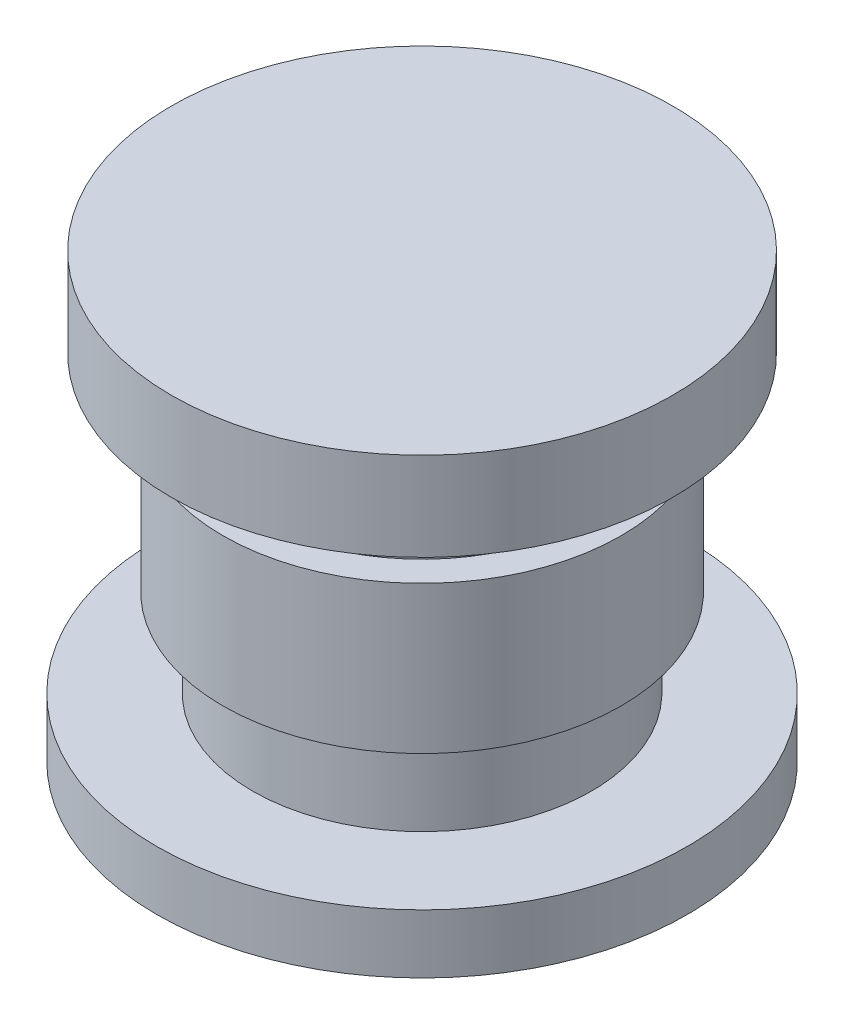
ISO-10303-21;
HEADER;
FILE_DESCRIPTION(('STEP AP214'),'2;1');
FILE_NAME('part.step','',(''),(''),'','','');
FILE_SCHEMA(('AUTOMOTIVE_DESIGN { 1 0 10303 214 1 1 1 1 }'));
ENDSEC;
DATA;
#1=APPLICATION_CONTEXT('core data for automotive mechanical design processes');
#2=APPLICATION_PROTOCOL_DEFINITION('international standard','automotive_design',2000,#1);
#3=PRODUCT_CONTEXT('',#1,'mechanical');
#4=PRODUCT('Part','Part','',(#3));
#5=PRODUCT_RELATED_PRODUCT_CATEGORY('part','',(#4));
#6=PRODUCT_DEFINITION_FORMATION('','',#4);
#7=PRODUCT_DEFINITION_CONTEXT('part definition',#1,'design');
#8=PRODUCT_DEFINITION('design','',#6,#7);
#9=PRODUCT_DEFINITION_SHAPE('','',#8);
#10=(LENGTH_UNIT() NAMED_UNIT(*) SI_UNIT(.MILLI.,.METRE.));
#11=(NAMED_UNIT(*) PLANE_ANGLE_UNIT() SI_UNIT($,.RADIAN.));
#12=(NAMED_UNIT(*) SI_UNIT($,.STERADIAN.) SOLID_ANGLE_UNIT());
#13=UNCERTAINTY_MEASURE_WITH_UNIT(LENGTH_MEASURE(1.E-05),#10,'distance_accuracy_value','');
#14=(GEOMETRIC_REPRESENTATION_CONTEXT(3) GLOBAL_UNCERTAINTY_ASSIGNED_CONTEXT((#13)) GLOBAL_UNIT_ASSIGNED_CONTEXT((#10,
#11,#12)) REPRESENTATION_CONTEXT('',''));
#15=CARTESIAN_POINT('',(0.,0.,0.));
#16=DIRECTION('',(0.,0.,1.));
#17=DIRECTION('',(1.,0.,0.));
#18=AXIS2_PLACEMENT_3D('',#15,#16,#17);
#19=CARTESIAN_POINT('',(0.,2.,0.));
#20=DIRECTION('',(0.,-1.,0.));
#21=DIRECTION('',(0.,0.,-1.));
#22=AXIS2_PLACEMENT_3D('',#19,#20,#21);
#23=CYLINDRICAL_SURFACE('',#22,9.);
#24=CARTESIAN_POINT('',(0.,2.,0.));
#25=DIRECTION('',(0.,1.,0.));
#26=DIRECTION('',(0.,0.,1.));
#27=AXIS2_PLACEMENT_3D('',#24,#25,#26);
#28=CIRCLE('',#27,9.);
#29=CARTESIAN_POINT('',(0.,2.,9.));
#30=VERTEX_POINT('',#29);
#31=EDGE_CURVE('E10',#30,#30,#28,.T.);
#32=ORIENTED_EDGE('',*,*,#31,.F.);
#33=EDGE_LOOP('',(#32));
#34=FACE_BOUND('',#33,.T.);
#35=CARTESIAN_POINT('',(0.,0.,0.));
#36=DIRECTION('',(0.,1.,0.));
#37=DIRECTION('',(0.,0.,1.));
#38=AXIS2_PLACEMENT_3D('',#35,#36,#37);
#39=CIRCLE('',#38,9.);
#40=CARTESIAN_POINT('',(0.,0.,9.));
#41=VERTEX_POINT('',#40);
#42=EDGE_CURVE('E34',#41,#41,#39,.T.);
#43=ORIENTED_EDGE('',*,*,#42,.T.);
#44=EDGE_LOOP('',(#43));
#45=FACE_BOUND('',#44,.T.);
#46=ADVANCED_FACE('F31',(#34,#45),#23,.T.);
#47=CARTESIAN_POINT('',(0.,2.,0.));
#48=DIRECTION('',(0.,1.,0.));
#49=DIRECTION('',(0.,0.,1.));
#50=AXIS2_PLACEMENT_3D('',#47,#48,#49);
#51=PLANE('',#50);
#52=CARTESIAN_POINT('',(0.,2.,0.));
#53=DIRECTION('',(0.,1.,0.));
#54=DIRECTION('',(0.,0.,1.));
#55=AXIS2_PLACEMENT_3D('',#52,#53,#54);
#56=CIRCLE('',#55,5.75);
#57=CARTESIAN_POINT('',(0.,2.,5.75));
#58=VERTEX_POINT('',#57);
#59=EDGE_CURVE('E43',#58,#58,#56,.T.);
#60=ORIENTED_EDGE('',*,*,#59,.F.);
#61=EDGE_LOOP('',(#60));
#62=FACE_BOUND('',#61,.T.);
#63=ORIENTED_EDGE('',*,*,#31,.T.);
#64=EDGE_LOOP('',(#63));
#65=FACE_BOUND('',#64,.T.);
#66=ADVANCED_FACE('F85',(#62,#65),#51,.T.);
#67=CARTESIAN_POINT('',(0.,0.,0.));
#68=DIRECTION('',(0.,1.,0.));
#69=DIRECTION('',(0.,0.,1.));
#70=AXIS2_PLACEMENT_3D('',#67,#68,#69);
#71=PLANE('',#70);
#72=ORIENTED_EDGE('',*,*,#42,.F.);
#73=EDGE_LOOP('',(#72));
#74=FACE_BOUND('',#73,.T.);
#75=ADVANCED_FACE('F90',(#74),#71,.F.);
#76=CARTESIAN_POINT('',(0.,5.,0.));
#77=DIRECTION('',(0.,-1.,0.));
#78=DIRECTION('',(0.,0.,-1.));
#79=AXIS2_PLACEMENT_3D('',#76,#77,#78);
#80=CYLINDRICAL_SURFACE('',#79,5.75);
#81=CARTESIAN_POINT('',(0.,5.,0.));
#82=DIRECTION('',(0.,1.,0.));
#83=DIRECTION('',(0.,0.,1.));
#84=AXIS2_PLACEMENT_3D('',#81,#82,#83);
#85=CIRCLE('',#84,5.75);
#86=CARTESIAN_POINT('',(0.,5.,5.75));
#87=VERTEX_POINT('',#86);
#88=EDGE_CURVE('E41',#87,#87,#85,.T.);
#89=ORIENTED_EDGE('',*,*,#88,.F.);
#90=EDGE_LOOP('',(#89));
#91=FACE_BOUND('',#90,.T.);
#92=ORIENTED_EDGE('',*,*,#59,.T.);
#93=EDGE_LOOP('',(#92));
#94=FACE_BOUND('',#93,.T.);
#95=ADVANCED_FACE('F97',(#91,#94),#80,.T.);
#96=CARTESIAN_POINT('',(0.,10.,0.));
#97=DIRECTION('',(0.,-1.,0.));
#98=DIRECTION('',(0.,0.,-1.));
#99=AXIS2_PLACEMENT_3D('',#96,#97,#98);
#100=CYLINDRICAL_SURFACE('',#99,6.75);
#101=CARTESIAN_POINT('',(0.,10.,0.));
#102=DIRECTION('',(0.,1.,0.));
#103=DIRECTION('',(0.,0.,1.));
#104=AXIS2_PLACEMENT_3D('',#101,#102,#103);
#105=CIRCLE('',#104,6.75);
#106=CARTESIAN_POINT('',(0.,10.,6.75));
#107=VERTEX_POINT('',#106);
#108=EDGE_CURVE('E46',#107,#107,#105,.T.);
#109=ORIENTED_EDGE('',*,*,#108,.F.);
#110=EDGE_LOOP('',(#109));
#111=FACE_BOUND('',#110,.T.);
#112=CARTESIAN_POINT('',(0.,5.,0.));
#113=DIRECTION('',(0.,1.,0.));
#114=DIRECTION('',(0.,0.,1.));
#115=AXIS2_PLACEMENT_3D('',#112,#113,#114);
#116=CIRCLE('',#115,6.75);
#117=CARTESIAN_POINT('',(0.,5.,6.75));
#118=VERTEX_POINT('',#117);
#119=EDGE_CURVE('E49',#118,#118,#116,.T.);
#120=ORIENTED_EDGE('',*,*,#119,.T.);
#121=EDGE_LOOP('',(#120));
#122=FACE_BOUND('',#121,.T.);
#123=ADVANCED_FACE('F101',(#111,#122),#100,.T.);
#124=CARTESIAN_POINT('',(0.,10.,0.));
#125=DIRECTION('',(0.,1.,0.));
#126=DIRECTION('',(0.,0.,1.));
#127=AXIS2_PLACEMENT_3D('',#124,#125,#126);
#128=PLANE('',#127);
#129=CARTESIAN_POINT('',(0.,10.,0.));
#130=DIRECTION('',(0.,1.,0.));
#131=DIRECTION('',(0.,0.,1.));
#132=AXIS2_PLACEMENT_3D('',#129,#130,#131);
#133=CIRCLE('',#132,5.75);
#134=CARTESIAN_POINT('',(0.,10.,5.75));
#135=VERTEX_POINT('',#134);
#136=EDGE_CURVE('E55',#135,#135,#133,.T.);
#137=ORIENTED_EDGE('',*,*,#136,.F.);
#138=EDGE_LOOP('',(#137));
#139=FACE_BOUND('',#138,.T.);
#140=ORIENTED_EDGE('',*,*,#108,.T.);
#141=EDGE_LOOP('',(#140));
#142=FACE_BOUND('',#141,.T.);
#143=ADVANCED_FACE('F107',(#139,#142),#128,.T.);
#144=CARTESIAN_POINT('',(0.,5.,0.));
#145=DIRECTION('',(0.,1.,0.));
#146=DIRECTION('',(0.,0.,1.));
#147=AXIS2_PLACEMENT_3D('',#144,#145,#146);
#148=PLANE('',#147);
#149=ORIENTED_EDGE('',*,*,#88,.T.);
#150=EDGE_LOOP('',(#149));
#151=FACE_BOUND('',#150,.T.);
#152=ORIENTED_EDGE('',*,*,#119,.F.);
#153=EDGE_LOOP('',(#152));
#154=FACE_BOUND('',#153,.T.);
#155=ADVANCED_FACE('F109',(#151,#154),#148,.F.);
#156=CARTESIAN_POINT('',(0.,12.,0.));
#157=DIRECTION('',(0.,-1.,0.));
#158=DIRECTION('',(0.,0.,-1.));
#159=AXIS2_PLACEMENT_3D('',#156,#157,#158);
#160=CYLINDRICAL_SURFACE('',#159,5.75);
#161=CARTESIAN_POINT('',(0.,12.,0.));
#162=DIRECTION('',(0.,1.,0.));
#163=DIRECTION('',(0.,0.,1.));
#164=AXIS2_PLACEMENT_3D('',#161,#162,#163);
#165=CIRCLE('',#164,5.75);
#166=CARTESIAN_POINT('',(0.,12.,5.75));
#167=VERTEX_POINT('',#166);
#168=EDGE_CURVE('E52',#167,#167,#165,.T.);
#169=ORIENTED_EDGE('',*,*,#168,.F.);
#170=EDGE_LOOP('',(#169));
#171=FACE_BOUND('',#170,.T.);
#172=ORIENTED_EDGE('',*,*,#136,.T.);
#173=EDGE_LOOP('',(#172));
#174=FACE_BOUND('',#173,.T.);
#175=ADVANCED_FACE('F72',(#171,#174),#160,.T.);
#176=CARTESIAN_POINT('',(0.,15.,0.));
#177=DIRECTION('',(0.,-1.,0.));
#178=DIRECTION('',(0.,0.,-1.));
#179=AXIS2_PLACEMENT_3D('',#176,#177,#178);
#180=CYLINDRICAL_SURFACE('',#179,8.5);
#181=CARTESIAN_POINT('',(0.,15.,0.));
#182=DIRECTION('',(0.,1.,0.));
#183=DIRECTION('',(0.,0.,1.));
#184=AXIS2_PLACEMENT_3D('',#181,#182,#183);
#185=CIRCLE('',#184,8.5);
#186=CARTESIAN_POINT('',(0.,15.,8.5));
#187=VERTEX_POINT('',#186);
#188=EDGE_CURVE('E58',#187,#187,#185,.T.);
#189=ORIENTED_EDGE('',*,*,#188,.F.);
#190=EDGE_LOOP('',(#189));
#191=FACE_BOUND('',#190,.T.);
#192=CARTESIAN_POINT('',(0.,12.,0.));
#193=DIRECTION('',(0.,1.,0.));
#194=DIRECTION('',(0.,0.,1.));
#195=AXIS2_PLACEMENT_3D('',#192,#193,#194);
#196=CIRCLE('',#195,8.5);
#197=CARTESIAN_POINT('',(0.,12.,8.5));
#198=VERTEX_POINT('',#197);
#199=EDGE_CURVE('E61',#198,#198,#196,.T.);
#200=ORIENTED_EDGE('',*,*,#199,.T.);
#201=EDGE_LOOP('',(#200));
#202=FACE_BOUND('',#201,.T.);
#203=ADVANCED_FACE('F69',(#191,#202),#180,.T.);
#204=CARTESIAN_POINT('',(0.,15.,0.));
#205=DIRECTION('',(0.,1.,0.));
#206=DIRECTION('',(0.,0.,1.));
#207=AXIS2_PLACEMENT_3D('',#204,#205,#206);
#208=PLANE('',#207);
#209=ORIENTED_EDGE('',*,*,#188,.T.);
#210=EDGE_LOOP('',(#209));
#211=FACE_BOUND('',#210,.T.);
#212=ADVANCED_FACE('F67',(#211),#208,.T.);
#213=CARTESIAN_POINT('',(0.,12.,0.));
#214=DIRECTION('',(0.,1.,0.));
#215=DIRECTION('',(0.,0.,1.));
#216=AXIS2_PLACEMENT_3D('',#213,#214,#215);
#217=PLANE('',#216);
#218=ORIENTED_EDGE('',*,*,#168,.T.);
#219=EDGE_LOOP('',(#218));
#220=FACE_BOUND('',#219,.T.);
#221=ORIENTED_EDGE('',*,*,#199,.F.);
#222=EDGE_LOOP('',(#221));
#223=FACE_BOUND('',#222,.T.);
#224=ADVANCED_FACE('F76',(#220,#223),#217,.F.);
#225=CLOSED_SHELL('',(#46,#66,#75,#95,#123,#143,#155,#175,#203,#212,#224));
#226=MANIFOLD_SOLID_BREP('B2',#225);
#227=ADVANCED_BREP_SHAPE_REPRESENTATION('',(#18,#226),#14);
#228=SHAPE_DEFINITION_REPRESENTATION(#9,#227);
ENDSEC;
END-ISO-10303-21;
